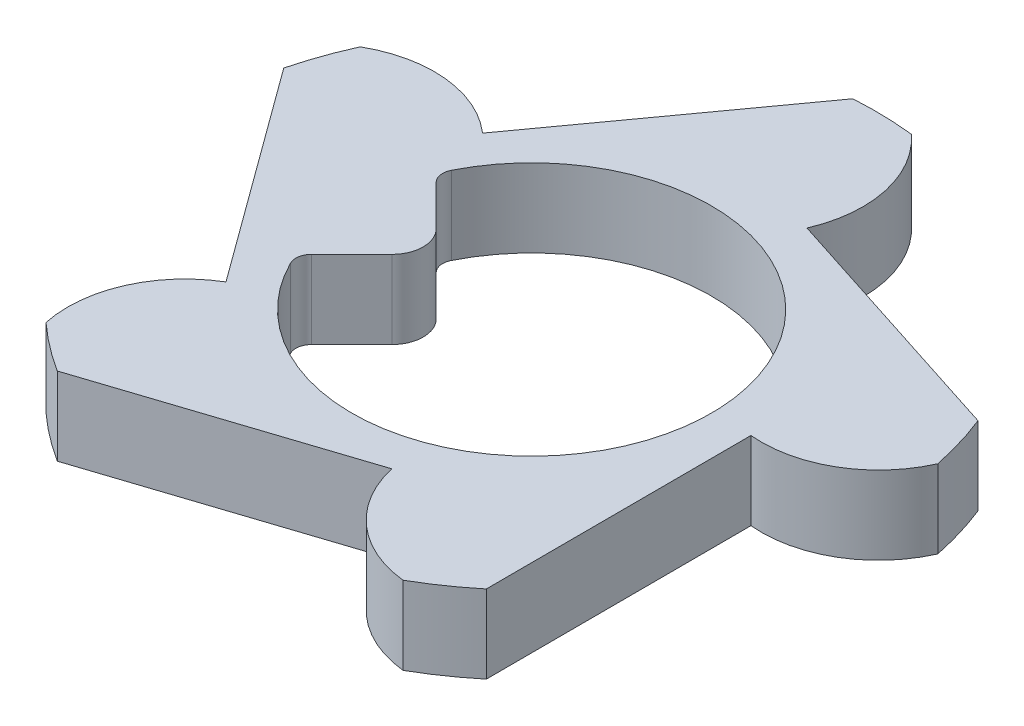
ISO-10303-21;
HEADER;
FILE_DESCRIPTION(('STEP AP214'),'2;1');
FILE_NAME('part.step','',(''),(''),'','','');
FILE_SCHEMA(('AUTOMOTIVE_DESIGN { 1 0 10303 214 1 1 1 1 }'));
ENDSEC;
DATA;
#1=APPLICATION_CONTEXT('core data for automotive mechanical design processes');
#2=APPLICATION_PROTOCOL_DEFINITION('international standard','automotive_design',2000,#1);
#3=PRODUCT_CONTEXT('',#1,'mechanical');
#4=PRODUCT('Part','Part','',(#3));
#5=PRODUCT_RELATED_PRODUCT_CATEGORY('part','',(#4));
#6=PRODUCT_DEFINITION_FORMATION('','',#4);
#7=PRODUCT_DEFINITION_CONTEXT('part definition',#1,'design');
#8=PRODUCT_DEFINITION('design','',#6,#7);
#9=PRODUCT_DEFINITION_SHAPE('','',#8);
#10=(LENGTH_UNIT() NAMED_UNIT(*) SI_UNIT(.MILLI.,.METRE.));
#11=(NAMED_UNIT(*) PLANE_ANGLE_UNIT() SI_UNIT($,.RADIAN.));
#12=(NAMED_UNIT(*) SI_UNIT($,.STERADIAN.) SOLID_ANGLE_UNIT());
#13=UNCERTAINTY_MEASURE_WITH_UNIT(LENGTH_MEASURE(1.E-05),#10,'distance_accuracy_value','');
#14=(GEOMETRIC_REPRESENTATION_CONTEXT(3) GLOBAL_UNCERTAINTY_ASSIGNED_CONTEXT((#13)) GLOBAL_UNIT_ASSIGNED_CONTEXT((#10,
#11,#12)) REPRESENTATION_CONTEXT('',''));
#15=CARTESIAN_POINT('',(0.,0.,0.));
#16=DIRECTION('',(0.,0.,1.));
#17=DIRECTION('',(1.,0.,0.));
#18=AXIS2_PLACEMENT_3D('',#15,#16,#17);
#19=CARTESIAN_POINT('',(0.,0.5,0.));
#20=DIRECTION('',(0.,-1.,0.));
#21=DIRECTION('',(0.,0.,-1.));
#22=AXIS2_PLACEMENT_3D('',#19,#20,#21);
#23=CYLINDRICAL_SURFACE('',#22,2.2);
#24=CARTESIAN_POINT('',(0.,0.,0.));
#25=DIRECTION('',(0.,1.,0.));
#26=DIRECTION('',(0.,0.,1.));
#27=AXIS2_PLACEMENT_3D('',#24,#25,#26);
#28=CIRCLE('',#27,2.2);
#29=CARTESIAN_POINT('',(0.243112339246083,0.,-2.18652610103477));
#30=VERTEX_POINT('',#29);
#31=CARTESIAN_POINT('',(-0.140209263389329,0.,-2.19552758180348));
#32=VERTEX_POINT('',#31);
#33=EDGE_CURVE('E210',#30,#32,#28,.T.);
#34=ORIENTED_EDGE('',*,*,#33,.T.);
#35=DIRECTION('',(0.,-1.,0.));
#36=VECTOR('',#35,1.);
#37=CARTESIAN_POINT('',(-0.140209263389329,0.5,-2.19552758180348));
#38=LINE('',#37,#36);
#39=CARTESIAN_POINT('',(-0.140209263389329,0.5,-2.19552758180348));
#40=VERTEX_POINT('',#39);
#41=EDGE_CURVE('E191',#40,#32,#38,.T.);
#42=ORIENTED_EDGE('',*,*,#41,.F.);
#43=CARTESIAN_POINT('',(0.,0.5,0.));
#44=DIRECTION('',(0.,1.,0.));
#45=DIRECTION('',(0.,0.,1.));
#46=AXIS2_PLACEMENT_3D('',#43,#44,#45);
#47=CIRCLE('',#46,2.2);
#48=CARTESIAN_POINT('',(0.243112339246083,0.5,-2.18652610103477));
#49=VERTEX_POINT('',#48);
#50=EDGE_CURVE('E198',#49,#40,#47,.T.);
#51=ORIENTED_EDGE('',*,*,#50,.F.);
#52=DIRECTION('',(0.,-1.,0.));
#53=VECTOR('',#52,1.);
#54=CARTESIAN_POINT('',(0.243112339246083,0.5,-2.18652610103477));
#55=LINE('',#54,#53);
#56=EDGE_CURVE('E282',#49,#30,#55,.T.);
#57=ORIENTED_EDGE('',*,*,#56,.T.);
#58=EDGE_LOOP('',(#34,#42,#51,#57));
#59=FACE_BOUND('',#58,.T.);
#60=ADVANCED_FACE('F45',(#59),#23,.T.);
#61=CARTESIAN_POINT('',(-1.13452842133559,0.5,-0.820271455788742));
#62=DIRECTION('',(0.810377443811132,0.,0.585908182706246));
#63=DIRECTION('',(0.585908182706246,0.,-0.810377443811132));
#64=AXIS2_PLACEMENT_3D('',#61,#62,#63);
#65=PLANE('',#64);
#66=DIRECTION('',(-0.585908182706246,0.,0.810377443811132));
#67=VECTOR('',#66,1.);
#68=CARTESIAN_POINT('',(-1.13452842133559,0.,-0.820271455788742));
#69=LINE('',#68,#67);
#70=CARTESIAN_POINT('',(-1.13452842133559,0.,-0.820271455788742));
#71=VERTEX_POINT('',#70);
#72=EDGE_CURVE('E284',#32,#71,#69,.T.);
#73=ORIENTED_EDGE('',*,*,#72,.T.);
#74=DIRECTION('',(0.,-1.,0.));
#75=VECTOR('',#74,1.);
#76=CARTESIAN_POINT('',(-1.13452842133559,0.5,-0.820271455788742));
#77=LINE('',#76,#75);
#78=CARTESIAN_POINT('',(-1.13452842133559,0.5,-0.820271455788742));
#79=VERTEX_POINT('',#78);
#80=EDGE_CURVE('E194',#79,#71,#77,.T.);
#81=ORIENTED_EDGE('',*,*,#80,.F.);
#82=DIRECTION('',(-0.585908182706246,0.,0.810377443811132));
#83=VECTOR('',#82,1.);
#84=CARTESIAN_POINT('',(-1.13452842133559,0.5,-0.820271455788742));
#85=LINE('',#84,#83);
#86=EDGE_CURVE('E187',#40,#79,#85,.T.);
#87=ORIENTED_EDGE('',*,*,#86,.F.);
#88=ORIENTED_EDGE('',*,*,#41,.T.);
#89=EDGE_LOOP('',(#73,#81,#87,#88));
#90=FACE_BOUND('',#89,.T.);
#91=ADVANCED_FACE('F189',(#90),#65,.F.);
#92=CARTESIAN_POINT('',(-1.62984623689458,0.5,-0.25710162208858));
#93=DIRECTION('',(0.,-1.,0.));
#94=DIRECTION('',(0.,0.,-1.));
#95=AXIS2_PLACEMENT_3D('',#92,#93,#94);
#96=CYLINDRICAL_SURFACE('',#95,0.75);
#97=CARTESIAN_POINT('',(-1.62984623689458,0.,-0.25710162208858));
#98=DIRECTION('',(0.,1.,0.));
#99=DIRECTION('',(0.,0.,1.));
#100=AXIS2_PLACEMENT_3D('',#97,#98,#99);
#101=CIRCLE('',#100,0.75);
#102=CARTESIAN_POINT('',(-2.00438405206926,0.,-0.906887298295876));
#103=VERTEX_POINT('',#102);
#104=EDGE_CURVE('E286',#71,#103,#101,.T.);
#105=ORIENTED_EDGE('',*,*,#104,.T.);
#106=DIRECTION('',(0.,-1.,0.));
#107=VECTOR('',#106,1.);
#108=CARTESIAN_POINT('',(-2.00438405206926,0.5,-0.906887298295876));
#109=LINE('',#108,#107);
#110=CARTESIAN_POINT('',(-2.00438405206926,0.5,-0.906887298295876));
#111=VERTEX_POINT('',#110);
#112=EDGE_CURVE('E216',#111,#103,#109,.T.);
#113=ORIENTED_EDGE('',*,*,#112,.F.);
#114=CARTESIAN_POINT('',(-1.62984623689458,0.5,-0.25710162208858));
#115=DIRECTION('',(0.,1.,0.));
#116=DIRECTION('',(0.,0.,1.));
#117=AXIS2_PLACEMENT_3D('',#114,#115,#116);
#118=CIRCLE('',#117,0.75);
#119=EDGE_CURVE('E197',#79,#111,#118,.T.);
#120=ORIENTED_EDGE('',*,*,#119,.F.);
#121=ORIENTED_EDGE('',*,*,#80,.T.);
#122=EDGE_LOOP('',(#105,#113,#120,#121));
#123=FACE_BOUND('',#122,.T.);
#124=ADVANCED_FACE('F368',(#123),#96,.T.);
#125=CARTESIAN_POINT('',(0.,0.5,0.));
#126=DIRECTION('',(0.,-1.,0.));
#127=DIRECTION('',(0.,0.,-1.));
#128=AXIS2_PLACEMENT_3D('',#125,#126,#127);
#129=CYLINDRICAL_SURFACE('',#128,2.2);
#130=CARTESIAN_POINT('',(0.,0.,0.));
#131=DIRECTION('',(0.,1.,0.));
#132=DIRECTION('',(0.,0.,1.));
#133=AXIS2_PLACEMENT_3D('',#130,#131,#132);
#134=CIRCLE('',#133,2.2);
#135=CARTESIAN_POINT('',(-2.13139785853603,0.,-0.545108400804861));
#136=VERTEX_POINT('',#135);
#137=EDGE_CURVE('E288',#103,#136,#134,.T.);
#138=ORIENTED_EDGE('',*,*,#137,.T.);
#139=DIRECTION('',(0.,-1.,0.));
#140=VECTOR('',#139,1.);
#141=CARTESIAN_POINT('',(-2.13139785853603,0.5,-0.545108400804861));
#142=LINE('',#141,#140);
#143=CARTESIAN_POINT('',(-2.13139785853603,0.5,-0.545108400804861));
#144=VERTEX_POINT('',#143);
#145=EDGE_CURVE('E342',#144,#136,#142,.T.);
#146=ORIENTED_EDGE('',*,*,#145,.F.);
#147=CARTESIAN_POINT('',(0.,0.5,0.));
#148=DIRECTION('',(0.,1.,0.));
#149=DIRECTION('',(0.,0.,1.));
#150=AXIS2_PLACEMENT_3D('',#147,#148,#149);
#151=CIRCLE('',#150,2.2);
#152=EDGE_CURVE('E259',#111,#144,#151,.T.);
#153=ORIENTED_EDGE('',*,*,#152,.F.);
#154=ORIENTED_EDGE('',*,*,#112,.T.);
#155=EDGE_LOOP('',(#138,#146,#153,#154));
#156=FACE_BOUND('',#155,.T.);
#157=ADVANCED_FACE('F349',(#156),#129,.T.);
#158=CARTESIAN_POINT('',(-1.13071307595288,0.5,0.825522828193851));
#159=DIRECTION('',(0.8076521971092,0.,-0.589659162995608));
#160=DIRECTION('',(-0.589659162995608,0.,-0.807652197109201));
#161=AXIS2_PLACEMENT_3D('',#158,#159,#160);
#162=PLANE('',#161);
#163=DIRECTION('',(0.589659162995608,0.,0.8076521971092));
#164=VECTOR('',#163,1.);
#165=CARTESIAN_POINT('',(-1.13071307595288,0.,0.825522828193851));
#166=LINE('',#165,#164);
#167=CARTESIAN_POINT('',(-1.13071307595288,0.,0.825522828193851));
#168=VERTEX_POINT('',#167);
#169=EDGE_CURVE('E290',#136,#168,#166,.T.);
#170=ORIENTED_EDGE('',*,*,#169,.T.);
#171=DIRECTION('',(0.,-1.,0.));
#172=VECTOR('',#171,1.);
#173=CARTESIAN_POINT('',(-1.13071307595288,0.5,0.825522828193851));
#174=LINE('',#173,#172);
#175=CARTESIAN_POINT('',(-1.13071307595288,0.5,0.825522828193851));
#176=VERTEX_POINT('',#175);
#177=EDGE_CURVE('E339',#176,#168,#174,.T.);
#178=ORIENTED_EDGE('',*,*,#177,.F.);
#179=DIRECTION('',(0.589659162995608,0.,0.8076521971092));
#180=VECTOR('',#179,1.);
#181=CARTESIAN_POINT('',(-1.13071307595288,0.5,0.825522828193851));
#182=LINE('',#181,#180);
#183=EDGE_CURVE('E261',#144,#176,#182,.T.);
#184=ORIENTED_EDGE('',*,*,#183,.F.);
#185=ORIENTED_EDGE('',*,*,#145,.T.);
#186=EDGE_LOOP('',(#170,#178,#184,#185));
#187=FACE_BOUND('',#186,.T.);
#188=ADVANCED_FACE('F360',(#187),#162,.F.);
#189=CARTESIAN_POINT('',(-0.748168358455879,0.5,1.47062711365099));
#190=DIRECTION('',(0.,-1.,0.));
#191=DIRECTION('',(0.,0.,-1.));
#192=AXIS2_PLACEMENT_3D('',#189,#190,#191);
#193=CYLINDRICAL_SURFACE('',#192,0.750000000000016);
#194=CARTESIAN_POINT('',(-0.748168358455879,0.,1.47062711365099));
#195=DIRECTION('',(0.,1.,0.));
#196=DIRECTION('',(0.,0.,1.));
#197=AXIS2_PLACEMENT_3D('',#194,#195,#196);
#198=CIRCLE('',#197,0.750000000000016);
#199=CARTESIAN_POINT('',(-1.48188980993314,0.,1.62603892672233));
#200=VERTEX_POINT('',#199);
#201=EDGE_CURVE('E292',#168,#200,#198,.T.);
#202=ORIENTED_EDGE('',*,*,#201,.T.);
#203=DIRECTION('',(0.,-1.,0.));
#204=VECTOR('',#203,1.);
#205=CARTESIAN_POINT('',(-1.48188980993314,0.5,1.62603892672233));
#206=LINE('',#205,#204);
#207=CARTESIAN_POINT('',(-1.48188980993314,0.5,1.62603892672233));
#208=VERTEX_POINT('',#207);
#209=EDGE_CURVE('E336',#208,#200,#206,.T.);
#210=ORIENTED_EDGE('',*,*,#209,.F.);
#211=CARTESIAN_POINT('',(-0.748168358455879,0.5,1.47062711365099));
#212=DIRECTION('',(0.,1.,0.));
#213=DIRECTION('',(0.,0.,1.));
#214=AXIS2_PLACEMENT_3D('',#211,#212,#213);
#215=CIRCLE('',#214,0.750000000000016);
#216=EDGE_CURVE('E263',#176,#208,#215,.T.);
#217=ORIENTED_EDGE('',*,*,#216,.F.);
#218=ORIENTED_EDGE('',*,*,#177,.T.);
#219=EDGE_LOOP('',(#202,#210,#217,#218));
#220=FACE_BOUND('',#219,.T.);
#221=ADVANCED_FACE('F364',(#220),#193,.T.);
#222=CARTESIAN_POINT('',(0.,0.5,0.));
#223=DIRECTION('',(0.,-1.,0.));
#224=DIRECTION('',(0.,0.,-1.));
#225=AXIS2_PLACEMENT_3D('',#222,#223,#224);
#226=CYLINDRICAL_SURFACE('',#225,2.2);
#227=CARTESIAN_POINT('',(0.,0.,0.));
#228=DIRECTION('',(0.,1.,0.));
#229=DIRECTION('',(0.,0.,1.));
#230=AXIS2_PLACEMENT_3D('',#227,#228,#229);
#231=CIRCLE('',#230,2.2);
#232=CARTESIAN_POINT('',(-1.17706705673467,0.,1.85863206255299));
#233=VERTEX_POINT('',#232);
#234=EDGE_CURVE('E294',#200,#233,#231,.T.);
#235=ORIENTED_EDGE('',*,*,#234,.T.);
#236=DIRECTION('',(0.,-1.,0.));
#237=VECTOR('',#236,1.);
#238=CARTESIAN_POINT('',(-1.17706705673467,0.5,1.85863206255299));
#239=LINE('',#238,#237);
#240=CARTESIAN_POINT('',(-1.17706705673467,0.5,1.85863206255299));
#241=VERTEX_POINT('',#240);
#242=EDGE_CURVE('E333',#241,#233,#239,.T.);
#243=ORIENTED_EDGE('',*,*,#242,.F.);
#244=CARTESIAN_POINT('',(0.,0.5,0.));
#245=DIRECTION('',(0.,1.,0.));
#246=DIRECTION('',(0.,0.,1.));
#247=AXIS2_PLACEMENT_3D('',#244,#245,#246);
#248=CIRCLE('',#247,2.2);
#249=EDGE_CURVE('E265',#208,#241,#248,.T.);
#250=ORIENTED_EDGE('',*,*,#249,.F.);
#251=ORIENTED_EDGE('',*,*,#209,.T.);
#252=EDGE_LOOP('',(#235,#243,#250,#251));
#253=FACE_BOUND('',#252,.T.);
#254=ADVANCED_FACE('F450',(#253),#226,.T.);
#255=CARTESIAN_POINT('',(0.435709308872771,0.5,1.33047262210149));
#256=DIRECTION('',(-0.311220934909123,0.,-0.950337587215349));
#257=DIRECTION('',(-0.950337587215349,0.,0.311220934909123));
#258=AXIS2_PLACEMENT_3D('',#255,#256,#257);
#259=PLANE('',#258);
#260=DIRECTION('',(0.950337587215349,0.,-0.311220934909123));
#261=VECTOR('',#260,1.);
#262=CARTESIAN_POINT('',(0.435709308872771,0.,1.33047262210149));
#263=LINE('',#262,#261);
#264=CARTESIAN_POINT('',(0.435709308872771,0.,1.33047262210149));
#265=VERTEX_POINT('',#264);
#266=EDGE_CURVE('E296',#233,#265,#263,.T.);
#267=ORIENTED_EDGE('',*,*,#266,.T.);
#268=DIRECTION('',(0.,-1.,0.));
#269=VECTOR('',#268,1.);
#270=CARTESIAN_POINT('',(0.435709308872771,0.5,1.33047262210149));
#271=LINE('',#270,#269);
#272=CARTESIAN_POINT('',(0.435709308872771,0.5,1.33047262210149));
#273=VERTEX_POINT('',#272);
#274=EDGE_CURVE('E330',#273,#265,#271,.T.);
#275=ORIENTED_EDGE('',*,*,#274,.F.);
#276=DIRECTION('',(0.950337587215349,0.,-0.311220934909123));
#277=VECTOR('',#276,1.);
#278=CARTESIAN_POINT('',(0.435709308872771,0.5,1.33047262210149));
#279=LINE('',#278,#277);
#280=EDGE_CURVE('E267',#241,#273,#279,.T.);
#281=ORIENTED_EDGE('',*,*,#280,.F.);
#282=ORIENTED_EDGE('',*,*,#242,.T.);
#283=EDGE_LOOP('',(#267,#275,#281,#282));
#284=FACE_BOUND('',#283,.T.);
#285=ADVANCED_FACE('F446',(#284),#259,.F.);
#286=CARTESIAN_POINT('',(1.16745276206162,0.5,1.16599916310206));
#287=DIRECTION('',(0.,-1.,0.));
#288=DIRECTION('',(0.,0.,-1.));
#289=AXIS2_PLACEMENT_3D('',#286,#287,#288);
#290=CYLINDRICAL_SURFACE('',#289,0.749999999999994);
#291=CARTESIAN_POINT('',(1.16745276206162,0.,1.16599916310206));
#292=DIRECTION('',(0.,1.,0.));
#293=DIRECTION('',(0.,0.,1.));
#294=AXIS2_PLACEMENT_3D('',#291,#292,#293);
#295=CIRCLE('',#294,0.749999999999994);
#296=CARTESIAN_POINT('',(1.08852578194846,0.,1.91183462204069));
#297=VERTEX_POINT('',#296);
#298=EDGE_CURVE('E298',#265,#297,#295,.T.);
#299=ORIENTED_EDGE('',*,*,#298,.T.);
#300=DIRECTION('',(0.,-1.,0.));
#301=VECTOR('',#300,1.);
#302=CARTESIAN_POINT('',(1.08852578194846,0.5,1.91183462204069));
#303=LINE('',#302,#301);
#304=CARTESIAN_POINT('',(1.08852578194846,0.5,1.91183462204069));
#305=VERTEX_POINT('',#304);
#306=EDGE_CURVE('E327',#305,#297,#303,.T.);
#307=ORIENTED_EDGE('',*,*,#306,.F.);
#308=CARTESIAN_POINT('',(1.16745276206162,0.5,1.16599916310206));
#309=DIRECTION('',(0.,1.,0.));
#310=DIRECTION('',(0.,0.,1.));
#311=AXIS2_PLACEMENT_3D('',#308,#309,#310);
#312=CIRCLE('',#311,0.749999999999994);
#313=EDGE_CURVE('E269',#273,#305,#312,.T.);
#314=ORIENTED_EDGE('',*,*,#313,.F.);
#315=ORIENTED_EDGE('',*,*,#274,.T.);
#316=EDGE_LOOP('',(#299,#307,#314,#315));
#317=FACE_BOUND('',#316,.T.);
#318=ADVANCED_FACE('F442',(#317),#290,.T.);
#319=CARTESIAN_POINT('',(0.,0.5,0.));
#320=DIRECTION('',(0.,-1.,0.));
#321=DIRECTION('',(0.,0.,-1.));
#322=AXIS2_PLACEMENT_3D('',#319,#320,#321);
#323=CYLINDRICAL_SURFACE('',#322,2.2);
#324=CARTESIAN_POINT('',(0.,0.,0.));
#325=DIRECTION('',(0.,1.,0.));
#326=DIRECTION('',(0.,0.,1.));
#327=AXIS2_PLACEMENT_3D('',#324,#325,#326);
#328=CIRCLE('',#327,2.2);
#329=CARTESIAN_POINT('',(1.40393041043621,0.,1.6938061880429));
#330=VERTEX_POINT('',#329);
#331=EDGE_CURVE('E300',#297,#330,#328,.T.);
#332=ORIENTED_EDGE('',*,*,#331,.T.);
#333=DIRECTION('',(0.,-1.,0.));
#334=VECTOR('',#333,1.);
#335=CARTESIAN_POINT('',(1.40393041043621,0.5,1.6938061880429));
#336=LINE('',#335,#334);
#337=CARTESIAN_POINT('',(1.40393041043621,0.5,1.6938061880429));
#338=VERTEX_POINT('',#337);
#339=EDGE_CURVE('E324',#338,#330,#336,.T.);
#340=ORIENTED_EDGE('',*,*,#339,.F.);
#341=CARTESIAN_POINT('',(0.,0.5,0.));
#342=DIRECTION('',(0.,1.,0.));
#343=DIRECTION('',(0.,0.,1.));
#344=AXIS2_PLACEMENT_3D('',#341,#342,#343);
#345=CIRCLE('',#344,2.2);
#346=EDGE_CURVE('E271',#305,#338,#345,.T.);
#347=ORIENTED_EDGE('',*,*,#346,.F.);
#348=ORIENTED_EDGE('',*,*,#306,.T.);
#349=EDGE_LOOP('',(#332,#340,#347,#348));
#350=FACE_BOUND('',#349,.T.);
#351=ADVANCED_FACE('F438',(#350),#323,.T.);
#352=CARTESIAN_POINT('',(1.39999623805097,0.5,-0.00324552663394069));
#353=DIRECTION('',(-0.99999731289355,0.,0.00231823330996412));
#354=DIRECTION('',(0.00231823330996412,0.,0.99999731289355));
#355=AXIS2_PLACEMENT_3D('',#352,#353,#354);
#356=PLANE('',#355);
#357=DIRECTION('',(-0.00231823330996412,0.,-0.99999731289355));
#358=VECTOR('',#357,1.);
#359=CARTESIAN_POINT('',(1.39999623805097,0.,-0.00324552663394069));
#360=LINE('',#359,#358);
#361=CARTESIAN_POINT('',(1.39999623805097,0.,-0.00324552663394069));
#362=VERTEX_POINT('',#361);
#363=EDGE_CURVE('E302',#330,#362,#360,.T.);
#364=ORIENTED_EDGE('',*,*,#363,.T.);
#365=DIRECTION('',(0.,-1.,0.));
#366=VECTOR('',#365,1.);
#367=CARTESIAN_POINT('',(1.39999623805097,0.5,-0.00324552663394069));
#368=LINE('',#367,#366);
#369=CARTESIAN_POINT('',(1.39999623805097,0.5,-0.00324552663394069));
#370=VERTEX_POINT('',#369);
#371=EDGE_CURVE('E321',#370,#362,#368,.T.);
#372=ORIENTED_EDGE('',*,*,#371,.F.);
#373=DIRECTION('',(-0.00231823330996412,0.,-0.99999731289355));
#374=VECTOR('',#373,1.);
#375=CARTESIAN_POINT('',(1.39999623805097,0.5,-0.00324552663394069));
#376=LINE('',#375,#374);
#377=EDGE_CURVE('E273',#338,#370,#376,.T.);
#378=ORIENTED_EDGE('',*,*,#377,.F.);
#379=ORIENTED_EDGE('',*,*,#339,.T.);
#380=EDGE_LOOP('',(#364,#372,#378,#379));
#381=FACE_BOUND('',#380,.T.);
#382=ADVANCED_FACE('F434',(#381),#356,.F.);
#383=CARTESIAN_POINT('',(1.46969384566992,0.5,-0.749999999999983));
#384=DIRECTION('',(0.,-1.,0.));
#385=DIRECTION('',(0.,0.,-1.));
#386=AXIS2_PLACEMENT_3D('',#383,#384,#385);
#387=CYLINDRICAL_SURFACE('',#386,0.75);
#388=CARTESIAN_POINT('',(1.46969384566992,0.,-0.749999999999983));
#389=DIRECTION('',(0.,1.,0.));
#390=DIRECTION('',(0.,0.,1.));
#391=AXIS2_PLACEMENT_3D('',#388,#389,#390);
#392=CIRCLE('',#391,0.75);
#393=CARTESIAN_POINT('',(2.15463574080784,0.,-0.444460149432384));
#394=VERTEX_POINT('',#393);
#395=EDGE_CURVE('E304',#362,#394,#392,.T.);
#396=ORIENTED_EDGE('',*,*,#395,.T.);
#397=DIRECTION('',(0.,-1.,0.));
#398=VECTOR('',#397,1.);
#399=CARTESIAN_POINT('',(2.15463574080784,0.5,-0.444460149432384));
#400=LINE('',#399,#398);
#401=CARTESIAN_POINT('',(2.15463574080784,0.5,-0.444460149432384));
#402=VERTEX_POINT('',#401);
#403=EDGE_CURVE('E318',#402,#394,#400,.T.);
#404=ORIENTED_EDGE('',*,*,#403,.F.);
#405=CARTESIAN_POINT('',(1.46969384566992,0.5,-0.749999999999983));
#406=DIRECTION('',(0.,1.,0.));
#407=DIRECTION('',(0.,0.,1.));
#408=AXIS2_PLACEMENT_3D('',#405,#406,#407);
#409=CIRCLE('',#408,0.75);
#410=EDGE_CURVE('E275',#370,#402,#409,.T.);
#411=ORIENTED_EDGE('',*,*,#410,.F.);
#412=ORIENTED_EDGE('',*,*,#371,.T.);
#413=EDGE_LOOP('',(#396,#404,#411,#412));
#414=FACE_BOUND('',#413,.T.);
#415=ADVANCED_FACE('F430',(#414),#387,.T.);
#416=CARTESIAN_POINT('',(0.,0.5,0.));
#417=DIRECTION('',(0.,-1.,0.));
#418=DIRECTION('',(0.,0.,-1.));
#419=AXIS2_PLACEMENT_3D('',#416,#417,#418);
#420=CYLINDRICAL_SURFACE('',#419,2.2);
#421=CARTESIAN_POINT('',(0.,0.,0.));
#422=DIRECTION('',(0.,1.,0.));
#423=DIRECTION('',(0.,0.,1.));
#424=AXIS2_PLACEMENT_3D('',#421,#422,#423);
#425=CIRCLE('',#424,2.2);
#426=CARTESIAN_POINT('',(2.04474376822384,0.,-0.811802267987579));
#427=VERTEX_POINT('',#426);
#428=EDGE_CURVE('E306',#394,#427,#425,.T.);
#429=ORIENTED_EDGE('',*,*,#428,.T.);
#430=DIRECTION('',(0.,-1.,0.));
#431=VECTOR('',#430,1.);
#432=CARTESIAN_POINT('',(2.04474376822384,0.5,-0.811802267987579));
#433=LINE('',#432,#431);
#434=CARTESIAN_POINT('',(2.04474376822384,0.5,-0.811802267987579));
#435=VERTEX_POINT('',#434);
#436=EDGE_CURVE('E315',#435,#427,#433,.T.);
#437=ORIENTED_EDGE('',*,*,#436,.F.);
#438=CARTESIAN_POINT('',(0.,0.5,0.));
#439=DIRECTION('',(0.,1.,0.));
#440=DIRECTION('',(0.,0.,1.));
#441=AXIS2_PLACEMENT_3D('',#438,#439,#440);
#442=CIRCLE('',#441,2.2);
#443=EDGE_CURVE('E277',#402,#435,#442,.T.);
#444=ORIENTED_EDGE('',*,*,#443,.F.);
#445=ORIENTED_EDGE('',*,*,#403,.T.);
#446=EDGE_LOOP('',(#429,#437,#444,#445));
#447=FACE_BOUND('',#446,.T.);
#448=ADVANCED_FACE('F426',(#447),#420,.T.);
#449=CARTESIAN_POINT('',(0.429535950364721,0.5,-1.33247846787266));
#450=DIRECTION('',(-0.306811393117655,0.,0.951770334194759));
#451=DIRECTION('',(0.951770334194759,0.,0.306811393117655));
#452=AXIS2_PLACEMENT_3D('',#449,#450,#451);
#453=PLANE('',#452);
#454=DIRECTION('',(-0.951770334194759,0.,-0.306811393117655));
#455=VECTOR('',#454,1.);
#456=CARTESIAN_POINT('',(0.429535950364721,0.,-1.33247846787266));
#457=LINE('',#456,#455);
#458=CARTESIAN_POINT('',(0.429535950364721,0.,-1.33247846787266));
#459=VERTEX_POINT('',#458);
#460=EDGE_CURVE('E308',#427,#459,#457,.T.);
#461=ORIENTED_EDGE('',*,*,#460,.T.);
#462=DIRECTION('',(0.,-1.,0.));
#463=VECTOR('',#462,1.);
#464=CARTESIAN_POINT('',(0.429535950364721,0.5,-1.33247846787266));
#465=LINE('',#464,#463);
#466=CARTESIAN_POINT('',(0.429535950364721,0.5,-1.33247846787266));
#467=VERTEX_POINT('',#466);
#468=EDGE_CURVE('E312',#467,#459,#465,.T.);
#469=ORIENTED_EDGE('',*,*,#468,.F.);
#470=DIRECTION('',(-0.951770334194759,0.,-0.306811393117655));
#471=VECTOR('',#470,1.);
#472=CARTESIAN_POINT('',(0.429535950364721,0.5,-1.33247846787266));
#473=LINE('',#472,#471);
#474=EDGE_CURVE('E279',#435,#467,#473,.T.);
#475=ORIENTED_EDGE('',*,*,#474,.F.);
#476=ORIENTED_EDGE('',*,*,#436,.T.);
#477=EDGE_LOOP('',(#461,#469,#475,#476));
#478=FACE_BOUND('',#477,.T.);
#479=ADVANCED_FACE('F422',(#478),#453,.F.);
#480=CARTESIAN_POINT('',(-0.259132012381083,0.5,-1.62952465466446));
#481=DIRECTION('',(0.,-1.,0.));
#482=DIRECTION('',(0.,0.,-1.));
#483=AXIS2_PLACEMENT_3D('',#480,#481,#482);
#484=CYLINDRICAL_SURFACE('',#483,0.750000000000004);
#485=CARTESIAN_POINT('',(-0.259132012381083,0.,-1.62952465466446));
#486=DIRECTION('',(0.,1.,0.));
#487=DIRECTION('',(0.,0.,1.));
#488=AXIS2_PLACEMENT_3D('',#485,#486,#487);
#489=CIRCLE('',#488,0.750000000000004);
#490=EDGE_CURVE('E207',#459,#30,#489,.T.);
#491=ORIENTED_EDGE('',*,*,#490,.T.);
#492=ORIENTED_EDGE('',*,*,#56,.F.);
#493=CARTESIAN_POINT('',(-0.259132012381083,0.5,-1.62952465466446));
#494=DIRECTION('',(0.,1.,0.));
#495=DIRECTION('',(0.,0.,1.));
#496=AXIS2_PLACEMENT_3D('',#493,#494,#495);
#497=CIRCLE('',#496,0.750000000000004);
#498=EDGE_CURVE('E203',#467,#49,#497,.T.);
#499=ORIENTED_EDGE('',*,*,#498,.F.);
#500=ORIENTED_EDGE('',*,*,#468,.T.);
#501=EDGE_LOOP('',(#491,#492,#499,#500));
#502=FACE_BOUND('',#501,.T.);
#503=ADVANCED_FACE('F417',(#502),#484,.T.);
#504=CARTESIAN_POINT('',(0.,0.5,0.));
#505=DIRECTION('',(0.,1.,0.));
#506=DIRECTION('',(0.,0.,1.));
#507=AXIS2_PLACEMENT_3D('',#504,#505,#506);
#508=PLANE('',#507);
#509=DIRECTION('',(-0.707106781186548,0.,0.707106781186547));
#510=VECTOR('',#509,1.);
#511=CARTESIAN_POINT('',(-0.611,0.5,0.));
#512=LINE('',#511,#510);
#513=CARTESIAN_POINT('',(-0.75242135623731,0.5,0.14142135623731));
#514=VERTEX_POINT('',#513);
#515=CARTESIAN_POINT('',(-1.00986068482738,0.5,0.398860684827382));
#516=VERTEX_POINT('',#515);
#517=EDGE_CURVE('E243',#514,#516,#512,.T.);
#518=ORIENTED_EDGE('',*,*,#517,.F.);
#519=CARTESIAN_POINT('',(-0.893842712474619,0.5,0.));
#520=DIRECTION('',(0.,1.,0.));
#521=DIRECTION('',(0.,0.,1.));
#522=AXIS2_PLACEMENT_3D('',#519,#520,#521);
#523=CIRCLE('',#522,0.2);
#524=CARTESIAN_POINT('',(-0.75242135623731,0.5,-0.14142135623731));
#525=VERTEX_POINT('',#524);
#526=EDGE_CURVE('E67',#514,#525,#523,.T.);
#527=ORIENTED_EDGE('',*,*,#526,.T.);
#528=DIRECTION('',(0.707106781186548,0.,0.707106781186547));
#529=VECTOR('',#528,1.);
#530=CARTESIAN_POINT('',(-1.059104505029,0.5,-0.448104505028997));
#531=LINE('',#530,#529);
#532=CARTESIAN_POINT('',(-1.00986068482738,0.5,-0.398860684827381));
#533=VERTEX_POINT('',#532);
#534=EDGE_CURVE('E251',#533,#525,#531,.T.);
#535=ORIENTED_EDGE('',*,*,#534,.F.);
#536=CARTESIAN_POINT('',(-0.939150006708727,0.5,-0.469571362946036));
#537=DIRECTION('',(0.,1.,0.));
#538=DIRECTION('',(0.,0.,1.));
#539=AXIS2_PLACEMENT_3D('',#536,#537,#538);
#540=CIRCLE('',#539,0.1);
#541=CARTESIAN_POINT('',(-1.02859286449051,0.5,-0.514292445131373));
#542=VERTEX_POINT('',#541);
#543=EDGE_CURVE('E226',#533,#542,#540,.F.);
#544=ORIENTED_EDGE('',*,*,#543,.T.);
#545=CARTESIAN_POINT('',(0.,0.5,0.));
#546=DIRECTION('',(0.,1.,0.));
#547=DIRECTION('',(0.,0.,1.));
#548=AXIS2_PLACEMENT_3D('',#545,#546,#547);
#549=CIRCLE('',#548,1.15);
#550=CARTESIAN_POINT('',(-1.02859286449051,0.5,0.514292445131373));
#551=VERTEX_POINT('',#550);
#552=EDGE_CURVE('E254',#551,#542,#549,.T.);
#553=ORIENTED_EDGE('',*,*,#552,.F.);
#554=CARTESIAN_POINT('',(-0.939150006708727,0.5,0.469571362946036));
#555=DIRECTION('',(0.,1.,0.));
#556=DIRECTION('',(0.,0.,1.));
#557=AXIS2_PLACEMENT_3D('',#554,#555,#556);
#558=CIRCLE('',#557,0.1);
#559=EDGE_CURVE('E231',#551,#516,#558,.F.);
#560=ORIENTED_EDGE('',*,*,#559,.T.);
#561=EDGE_LOOP('',(#518,#527,#535,#544,#553,#560));
#562=FACE_BOUND('',#561,.T.);
#563=ORIENTED_EDGE('',*,*,#50,.T.);
#564=ORIENTED_EDGE('',*,*,#86,.T.);
#565=ORIENTED_EDGE('',*,*,#119,.T.);
#566=ORIENTED_EDGE('',*,*,#152,.T.);
#567=ORIENTED_EDGE('',*,*,#183,.T.);
#568=ORIENTED_EDGE('',*,*,#216,.T.);
#569=ORIENTED_EDGE('',*,*,#249,.T.);
#570=ORIENTED_EDGE('',*,*,#280,.T.);
#571=ORIENTED_EDGE('',*,*,#313,.T.);
#572=ORIENTED_EDGE('',*,*,#346,.T.);
#573=ORIENTED_EDGE('',*,*,#377,.T.);
#574=ORIENTED_EDGE('',*,*,#410,.T.);
#575=ORIENTED_EDGE('',*,*,#443,.T.);
#576=ORIENTED_EDGE('',*,*,#474,.T.);
#577=ORIENTED_EDGE('',*,*,#498,.T.);
#578=EDGE_LOOP('',(#563,#564,#565,#566,#567,#568,#569,#570,#571,#572,#573,#574,#575,#576,#577));
#579=FACE_BOUND('',#578,.T.);
#580=ADVANCED_FACE('F201',(#562,#579),#508,.T.);
#581=CARTESIAN_POINT('',(0.,0.,0.));
#582=DIRECTION('',(0.,1.,0.));
#583=DIRECTION('',(0.,0.,1.));
#584=AXIS2_PLACEMENT_3D('',#581,#582,#583);
#585=PLANE('',#584);
#586=DIRECTION('',(-0.707106781186548,0.,-0.707106781186547));
#587=VECTOR('',#586,1.);
#588=CARTESIAN_POINT('',(-1.059104505029,0.,-0.448104505028997));
#589=LINE('',#588,#587);
#590=CARTESIAN_POINT('',(-0.75242135623731,0.,-0.141421356237309));
#591=VERTEX_POINT('',#590);
#592=CARTESIAN_POINT('',(-1.00986068482738,0.,-0.398860684827381));
#593=VERTEX_POINT('',#592);
#594=EDGE_CURVE('E250',#591,#593,#589,.T.);
#595=ORIENTED_EDGE('',*,*,#594,.F.);
#596=CARTESIAN_POINT('',(-0.893842712474619,0.,0.));
#597=DIRECTION('',(0.,1.,0.));
#598=DIRECTION('',(0.,0.,1.));
#599=AXIS2_PLACEMENT_3D('',#596,#597,#598);
#600=CIRCLE('',#599,0.2);
#601=CARTESIAN_POINT('',(-0.75242135623731,0.,0.14142135623731));
#602=VERTEX_POINT('',#601);
#603=EDGE_CURVE('E13',#591,#602,#600,.F.);
#604=ORIENTED_EDGE('',*,*,#603,.T.);
#605=DIRECTION('',(0.707106781186548,0.,-0.707106781186547));
#606=VECTOR('',#605,1.);
#607=CARTESIAN_POINT('',(-0.611,0.,0.));
#608=LINE('',#607,#606);
#609=CARTESIAN_POINT('',(-1.00986068482738,0.,0.398860684827382));
#610=VERTEX_POINT('',#609);
#611=EDGE_CURVE('E245',#610,#602,#608,.T.);
#612=ORIENTED_EDGE('',*,*,#611,.F.);
#613=CARTESIAN_POINT('',(-0.939150006708727,0.,0.469571362946036));
#614=DIRECTION('',(0.,1.,0.));
#615=DIRECTION('',(0.,0.,1.));
#616=AXIS2_PLACEMENT_3D('',#613,#614,#615);
#617=CIRCLE('',#616,0.1);
#618=CARTESIAN_POINT('',(-1.02859286449051,0.,0.514292445131373));
#619=VERTEX_POINT('',#618);
#620=EDGE_CURVE('E234',#610,#619,#617,.T.);
#621=ORIENTED_EDGE('',*,*,#620,.T.);
#622=CARTESIAN_POINT('',(0.,0.,0.));
#623=DIRECTION('',(0.,1.,0.));
#624=DIRECTION('',(0.,0.,1.));
#625=AXIS2_PLACEMENT_3D('',#622,#623,#624);
#626=CIRCLE('',#625,1.15);
#627=CARTESIAN_POINT('',(-1.02859286449051,0.,-0.514292445131373));
#628=VERTEX_POINT('',#627);
#629=EDGE_CURVE('E397',#628,#619,#626,.F.);
#630=ORIENTED_EDGE('',*,*,#629,.F.);
#631=CARTESIAN_POINT('',(-0.939150006708727,0.,-0.469571362946036));
#632=DIRECTION('',(0.,1.,0.));
#633=DIRECTION('',(0.,0.,1.));
#634=AXIS2_PLACEMENT_3D('',#631,#632,#633);
#635=CIRCLE('',#634,0.1);
#636=EDGE_CURVE('E228',#628,#593,#635,.T.);
#637=ORIENTED_EDGE('',*,*,#636,.T.);
#638=EDGE_LOOP('',(#595,#604,#612,#621,#630,#637));
#639=FACE_BOUND('',#638,.T.);
#640=ORIENTED_EDGE('',*,*,#33,.F.);
#641=ORIENTED_EDGE('',*,*,#490,.F.);
#642=ORIENTED_EDGE('',*,*,#460,.F.);
#643=ORIENTED_EDGE('',*,*,#428,.F.);
#644=ORIENTED_EDGE('',*,*,#395,.F.);
#645=ORIENTED_EDGE('',*,*,#363,.F.);
#646=ORIENTED_EDGE('',*,*,#331,.F.);
#647=ORIENTED_EDGE('',*,*,#298,.F.);
#648=ORIENTED_EDGE('',*,*,#266,.F.);
#649=ORIENTED_EDGE('',*,*,#234,.F.);
#650=ORIENTED_EDGE('',*,*,#201,.F.);
#651=ORIENTED_EDGE('',*,*,#169,.F.);
#652=ORIENTED_EDGE('',*,*,#137,.F.);
#653=ORIENTED_EDGE('',*,*,#104,.F.);
#654=ORIENTED_EDGE('',*,*,#72,.F.);
#655=EDGE_LOOP('',(#640,#641,#642,#643,#644,#645,#646,#647,#648,#649,#650,#651,#652,#653,#654));
#656=FACE_BOUND('',#655,.T.);
#657=ADVANCED_FACE('F355',(#639,#656),#585,.F.);
#658=CARTESIAN_POINT('',(0.,-0.00100000000000002,0.));
#659=DIRECTION('',(0.,1.,0.));
#660=DIRECTION('',(0.,0.,1.));
#661=AXIS2_PLACEMENT_3D('',#658,#659,#660);
#662=CYLINDRICAL_SURFACE('',#661,1.15);
#663=ORIENTED_EDGE('',*,*,#552,.T.);
#664=DIRECTION('',(0.,1.,0.));
#665=VECTOR('',#664,1.);
#666=CARTESIAN_POINT('',(-1.02859286449051,-0.00100000000000002,-0.514292445131373));
#667=LINE('',#666,#665);
#668=EDGE_CURVE('E222',#542,#628,#667,.F.);
#669=ORIENTED_EDGE('',*,*,#668,.T.);
#670=ORIENTED_EDGE('',*,*,#629,.T.);
#671=DIRECTION('',(0.,1.,0.));
#672=VECTOR('',#671,1.);
#673=CARTESIAN_POINT('',(-1.02859286449051,-0.00100000000000002,0.514292445131373));
#674=LINE('',#673,#672);
#675=EDGE_CURVE('E214',#619,#551,#674,.T.);
#676=ORIENTED_EDGE('',*,*,#675,.T.);
#677=EDGE_LOOP('',(#663,#669,#670,#676));
#678=FACE_BOUND('',#677,.T.);
#679=ADVANCED_FACE('F401',(#678),#662,.F.);
#680=CARTESIAN_POINT('',(-0.611,-0.00100000000000002,0.));
#681=DIRECTION('',(-0.707106781186548,0.,-0.707106781186548));
#682=DIRECTION('',(-0.707106781186548,0.,0.707106781186547));
#683=AXIS2_PLACEMENT_3D('',#680,#681,#682);
#684=PLANE('',#683);
#685=ORIENTED_EDGE('',*,*,#611,.T.);
#686=DIRECTION('',(0.,1.,0.));
#687=VECTOR('',#686,1.);
#688=CARTESIAN_POINT('',(-0.75242135623731,-0.00100000000000002,0.14142135623731));
#689=LINE('',#688,#687);
#690=EDGE_CURVE('E236',#602,#514,#689,.T.);
#691=ORIENTED_EDGE('',*,*,#690,.T.);
#692=ORIENTED_EDGE('',*,*,#517,.T.);
#693=DIRECTION('',(0.,-1.,0.));
#694=VECTOR('',#693,1.);
#695=CARTESIAN_POINT('',(-1.00986068482738,0.,0.398860684827382));
#696=LINE('',#695,#694);
#697=EDGE_CURVE('E224',#516,#610,#696,.T.);
#698=ORIENTED_EDGE('',*,*,#697,.T.);
#699=EDGE_LOOP('',(#685,#691,#692,#698));
#700=FACE_BOUND('',#699,.T.);
#701=ADVANCED_FACE('F242',(#700),#684,.F.);
#702=CARTESIAN_POINT('',(-1.059104505029,-0.00100000000000002,-0.448104505028997));
#703=DIRECTION('',(-0.707106781186547,0.,0.707106781186548));
#704=DIRECTION('',(0.707106781186548,0.,0.707106781186547));
#705=AXIS2_PLACEMENT_3D('',#702,#703,#704);
#706=PLANE('',#705);
#707=ORIENTED_EDGE('',*,*,#534,.T.);
#708=DIRECTION('',(0.,1.,0.));
#709=VECTOR('',#708,1.);
#710=CARTESIAN_POINT('',(-0.75242135623731,-0.00100000000000002,-0.141421356237309));
#711=LINE('',#710,#709);
#712=EDGE_CURVE('E53',#525,#591,#711,.F.);
#713=ORIENTED_EDGE('',*,*,#712,.T.);
#714=ORIENTED_EDGE('',*,*,#594,.T.);
#715=DIRECTION('',(0.,-1.,0.));
#716=VECTOR('',#715,1.);
#717=CARTESIAN_POINT('',(-1.00986068482738,0.5,-0.398860684827381));
#718=LINE('',#717,#716);
#719=EDGE_CURVE('E211',#593,#533,#718,.F.);
#720=ORIENTED_EDGE('',*,*,#719,.T.);
#721=EDGE_LOOP('',(#707,#713,#714,#720));
#722=FACE_BOUND('',#721,.T.);
#723=ADVANCED_FACE('F385',(#722),#706,.F.);
#724=CARTESIAN_POINT('',(-0.939150006708727,-0.00100000000000002,-0.469571362946036));
#725=DIRECTION('',(0.,1.,0.));
#726=DIRECTION('',(0.,0.,1.));
#727=AXIS2_PLACEMENT_3D('',#724,#725,#726);
#728=CYLINDRICAL_SURFACE('',#727,0.1);
#729=ORIENTED_EDGE('',*,*,#636,.F.);
#730=ORIENTED_EDGE('',*,*,#668,.F.);
#731=ORIENTED_EDGE('',*,*,#543,.F.);
#732=ORIENTED_EDGE('',*,*,#719,.F.);
#733=EDGE_LOOP('',(#729,#730,#731,#732));
#734=FACE_BOUND('',#733,.T.);
#735=ADVANCED_FACE('F382',(#734),#728,.F.);
#736=CARTESIAN_POINT('',(-0.939150006708727,-0.00100000000000002,0.469571362946036));
#737=DIRECTION('',(0.,1.,0.));
#738=DIRECTION('',(0.,0.,1.));
#739=AXIS2_PLACEMENT_3D('',#736,#737,#738);
#740=CYLINDRICAL_SURFACE('',#739,0.1);
#741=ORIENTED_EDGE('',*,*,#620,.F.);
#742=ORIENTED_EDGE('',*,*,#697,.F.);
#743=ORIENTED_EDGE('',*,*,#559,.F.);
#744=ORIENTED_EDGE('',*,*,#675,.F.);
#745=EDGE_LOOP('',(#741,#742,#743,#744));
#746=FACE_BOUND('',#745,.T.);
#747=ADVANCED_FACE('F384',(#746),#740,.F.);
#748=CARTESIAN_POINT('',(-0.893842712474619,-0.00100000000000002,0.));
#749=DIRECTION('',(0.,1.,0.));
#750=DIRECTION('',(0.,0.,1.));
#751=AXIS2_PLACEMENT_3D('',#748,#749,#750);
#752=CYLINDRICAL_SURFACE('',#751,0.2);
#753=ORIENTED_EDGE('',*,*,#603,.F.);
#754=ORIENTED_EDGE('',*,*,#712,.F.);
#755=ORIENTED_EDGE('',*,*,#526,.F.);
#756=ORIENTED_EDGE('',*,*,#690,.F.);
#757=EDGE_LOOP('',(#753,#754,#755,#756));
#758=FACE_BOUND('',#757,.T.);
#759=ADVANCED_FACE('F47',(#758),#752,.T.);
#760=CLOSED_SHELL('',(#60,#91,#124,#157,#188,#221,#254,#285,#318,#351,#382,#415,#448,#479,#503,
#580,#657,#679,#701,#723,#735,#747,#759));
#761=MANIFOLD_SOLID_BREP('B2',#760);
#762=ADVANCED_BREP_SHAPE_REPRESENTATION('',(#18,#761),#14);
#763=SHAPE_DEFINITION_REPRESENTATION(#9,#762);
ENDSEC;
END-ISO-10303-21;
